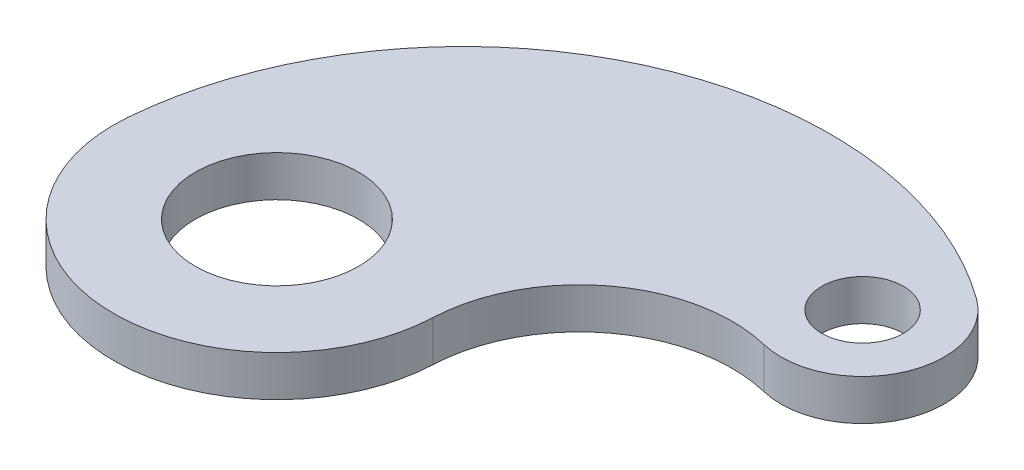
ISO-10303-21;
HEADER;
FILE_DESCRIPTION(('STEP AP214'),'2;1');
FILE_NAME('part.step','',(''),(''),'','','');
FILE_SCHEMA(('AUTOMOTIVE_DESIGN { 1 0 10303 214 1 1 1 1 }'));
ENDSEC;
DATA;
#1=APPLICATION_CONTEXT('core data for automotive mechanical design processes');
#2=APPLICATION_PROTOCOL_DEFINITION('international standard','automotive_design',2000,#1);
#3=PRODUCT_CONTEXT('',#1,'mechanical');
#4=PRODUCT('Part','Part','',(#3));
#5=PRODUCT_RELATED_PRODUCT_CATEGORY('part','',(#4));
#6=PRODUCT_DEFINITION_FORMATION('','',#4);
#7=PRODUCT_DEFINITION_CONTEXT('part definition',#1,'design');
#8=PRODUCT_DEFINITION('design','',#6,#7);
#9=PRODUCT_DEFINITION_SHAPE('','',#8);
#10=(LENGTH_UNIT() NAMED_UNIT(*) SI_UNIT(.MILLI.,.METRE.));
#11=(NAMED_UNIT(*) PLANE_ANGLE_UNIT() SI_UNIT($,.RADIAN.));
#12=(NAMED_UNIT(*) SI_UNIT($,.STERADIAN.) SOLID_ANGLE_UNIT());
#13=UNCERTAINTY_MEASURE_WITH_UNIT(LENGTH_MEASURE(1.E-05),#10,'distance_accuracy_value','');
#14=(GEOMETRIC_REPRESENTATION_CONTEXT(3) GLOBAL_UNCERTAINTY_ASSIGNED_CONTEXT((#13)) GLOBAL_UNIT_ASSIGNED_CONTEXT((#10,
#11,#12)) REPRESENTATION_CONTEXT('',''));
#15=CARTESIAN_POINT('',(0.,0.,0.));
#16=DIRECTION('',(0.,0.,1.));
#17=DIRECTION('',(1.,0.,0.));
#18=AXIS2_PLACEMENT_3D('',#15,#16,#17);
#19=CARTESIAN_POINT('',(49.8266857113889,20.,4.15949408203427));
#20=DIRECTION('',(0.,1.,0.));
#21=DIRECTION('',(0.,0.,1.));
#22=AXIS2_PLACEMENT_3D('',#19,#20,#21);
#23=PLANE('',#22);
#24=CARTESIAN_POINT('',(0.,20.,0.));
#25=DIRECTION('',(0.,1.,0.));
#26=DIRECTION('',(0.,0.,1.));
#27=AXIS2_PLACEMENT_3D('',#24,#25,#26);
#28=CIRCLE('',#27,40.);
#29=CARTESIAN_POINT('',(0.,20.,40.));
#30=VERTEX_POINT('',#29);
#31=EDGE_CURVE('E118',#30,#30,#28,.T.);
#32=ORIENTED_EDGE('',*,*,#31,.F.);
#33=EDGE_LOOP('',(#32));
#34=FACE_BOUND('',#33,.T.);
#35=CARTESIAN_POINT('',(99.6533714227777,20.,8.31898816406854));
#36=DIRECTION('',(0.,1.,0.));
#37=DIRECTION('',(0.,0.,1.));
#38=AXIS2_PLACEMENT_3D('',#35,#36,#37);
#39=CIRCLE('',#38,180.);
#40=CARTESIAN_POINT('',(205.354467186718,20.,-137.376853761164));
#41=VERTEX_POINT('',#40);
#42=CARTESIAN_POINT('',(-79.7226971382222,20.,-6.65519053125484));
#43=VERTEX_POINT('',#42);
#44=EDGE_CURVE('E98',#41,#43,#39,.T.);
#45=ORIENTED_EDGE('',*,*,#44,.T.);
#46=CARTESIAN_POINT('',(0.,20.,0.));
#47=DIRECTION('',(0.,1.,0.));
#48=DIRECTION('',(0.,0.,1.));
#49=AXIS2_PLACEMENT_3D('',#46,#47,#48);
#50=CIRCLE('',#49,80.);
#51=CARTESIAN_POINT('',(79.9233798492186,20.,3.5004790354358));
#52=VERTEX_POINT('',#51);
#53=EDGE_CURVE('E93',#43,#52,#50,.T.);
#54=ORIENTED_EDGE('',*,*,#53,.T.);
#55=CARTESIAN_POINT('',(154.851548457861,20.,6.78217813115695));
#56=DIRECTION('',(0.,-1.,0.));
#57=DIRECTION('',(0.,0.,1.));
#58=AXIS2_PLACEMENT_3D('',#55,#56,#57);
#59=CIRCLE('',#58,75.);
#60=CARTESIAN_POINT('',(172.469235199298,20.,-66.1192423891634));
#61=VERTEX_POINT('',#60);
#62=EDGE_CURVE('E96',#52,#61,#59,.T.);
#63=ORIENTED_EDGE('',*,*,#62,.T.);
#64=CARTESIAN_POINT('',(181.865334794732,20.,-105.000000000001));
#65=DIRECTION('',(0.,1.,0.));
#66=DIRECTION('',(0.,0.,1.));
#67=AXIS2_PLACEMENT_3D('',#64,#65,#66);
#68=CIRCLE('',#67,40.);
#69=EDGE_CURVE('E63',#61,#41,#68,.T.);
#70=ORIENTED_EDGE('',*,*,#69,.T.);
#71=EDGE_LOOP('',(#45,#54,#63,#70));
#72=FACE_BOUND('',#71,.T.);
#73=CARTESIAN_POINT('',(181.865334794732,20.,-105.000000000001));
#74=DIRECTION('',(0.,1.,0.));
#75=DIRECTION('',(0.,0.,1.));
#76=AXIS2_PLACEMENT_3D('',#73,#74,#75);
#77=CIRCLE('',#76,20.);
#78=CARTESIAN_POINT('',(181.865334794732,20.,-85.0000000000009));
#79=VERTEX_POINT('',#78);
#80=EDGE_CURVE('E140',#79,#79,#77,.T.);
#81=ORIENTED_EDGE('',*,*,#80,.F.);
#82=EDGE_LOOP('',(#81));
#83=FACE_BOUND('',#82,.T.);
#84=ADVANCED_FACE('F45',(#34,#72,#83),#23,.T.);
#85=CARTESIAN_POINT('',(49.8266857113889,0.,4.15949408203427));
#86=DIRECTION('',(0.,1.,0.));
#87=DIRECTION('',(0.,0.,1.));
#88=AXIS2_PLACEMENT_3D('',#85,#86,#87);
#89=PLANE('',#88);
#90=CARTESIAN_POINT('',(99.6533714227777,0.,8.31898816406854));
#91=DIRECTION('',(0.,1.,0.));
#92=DIRECTION('',(0.,0.,1.));
#93=AXIS2_PLACEMENT_3D('',#90,#91,#92);
#94=CIRCLE('',#93,180.);
#95=CARTESIAN_POINT('',(205.354467186718,0.,-137.376853761164));
#96=VERTEX_POINT('',#95);
#97=CARTESIAN_POINT('',(-79.7226971382222,0.,-6.65519053125484));
#98=VERTEX_POINT('',#97);
#99=EDGE_CURVE('E114',#96,#98,#94,.T.);
#100=ORIENTED_EDGE('',*,*,#99,.F.);
#101=CARTESIAN_POINT('',(181.865334794732,0.,-105.000000000001));
#102=DIRECTION('',(0.,1.,0.));
#103=DIRECTION('',(0.,0.,1.));
#104=AXIS2_PLACEMENT_3D('',#101,#102,#103);
#105=CIRCLE('',#104,40.);
#106=CARTESIAN_POINT('',(172.469235199298,0.,-66.1192423891634));
#107=VERTEX_POINT('',#106);
#108=EDGE_CURVE('E86',#107,#96,#105,.T.);
#109=ORIENTED_EDGE('',*,*,#108,.F.);
#110=CARTESIAN_POINT('',(154.851548457861,0.,6.78217813115695));
#111=DIRECTION('',(0.,-1.,0.));
#112=DIRECTION('',(0.,0.,1.));
#113=AXIS2_PLACEMENT_3D('',#110,#111,#112);
#114=CIRCLE('',#113,75.);
#115=CARTESIAN_POINT('',(79.9233798492186,0.,3.5004790354358));
#116=VERTEX_POINT('',#115);
#117=EDGE_CURVE('E80',#116,#107,#114,.T.);
#118=ORIENTED_EDGE('',*,*,#117,.F.);
#119=CARTESIAN_POINT('',(0.,0.,0.));
#120=DIRECTION('',(0.,1.,0.));
#121=DIRECTION('',(0.,0.,1.));
#122=AXIS2_PLACEMENT_3D('',#119,#120,#121);
#123=CIRCLE('',#122,80.);
#124=EDGE_CURVE('E103',#98,#116,#123,.T.);
#125=ORIENTED_EDGE('',*,*,#124,.F.);
#126=EDGE_LOOP('',(#100,#109,#118,#125));
#127=FACE_BOUND('',#126,.T.);
#128=CARTESIAN_POINT('',(0.,0.,0.));
#129=DIRECTION('',(0.,1.,0.));
#130=DIRECTION('',(0.,0.,1.));
#131=AXIS2_PLACEMENT_3D('',#128,#129,#130);
#132=CIRCLE('',#131,40.);
#133=CARTESIAN_POINT('',(0.,0.,40.));
#134=VERTEX_POINT('',#133);
#135=EDGE_CURVE('E136',#134,#134,#132,.T.);
#136=ORIENTED_EDGE('',*,*,#135,.T.);
#137=EDGE_LOOP('',(#136));
#138=FACE_BOUND('',#137,.T.);
#139=CARTESIAN_POINT('',(181.865334794732,0.,-105.000000000001));
#140=DIRECTION('',(0.,1.,0.));
#141=DIRECTION('',(0.,0.,1.));
#142=AXIS2_PLACEMENT_3D('',#139,#140,#141);
#143=CIRCLE('',#142,20.);
#144=CARTESIAN_POINT('',(181.865334794732,0.,-85.0000000000009));
#145=VERTEX_POINT('',#144);
#146=EDGE_CURVE('E144',#145,#145,#143,.T.);
#147=ORIENTED_EDGE('',*,*,#146,.T.);
#148=EDGE_LOOP('',(#147));
#149=FACE_BOUND('',#148,.T.);
#150=ADVANCED_FACE('F131',(#127,#138,#149),#89,.F.);
#151=CARTESIAN_POINT('',(99.6533714227777,20.,8.31898816406854));
#152=DIRECTION('',(0.,-1.,0.));
#153=DIRECTION('',(0.,0.,-1.));
#154=AXIS2_PLACEMENT_3D('',#151,#152,#153);
#155=CYLINDRICAL_SURFACE('',#154,180.);
#156=ORIENTED_EDGE('',*,*,#99,.T.);
#157=DIRECTION('',(0.,-1.,0.));
#158=VECTOR('',#157,1.);
#159=CARTESIAN_POINT('',(-79.7226971382222,20.,-6.65519053125484));
#160=LINE('',#159,#158);
#161=EDGE_CURVE('E11',#43,#98,#160,.T.);
#162=ORIENTED_EDGE('',*,*,#161,.F.);
#163=ORIENTED_EDGE('',*,*,#44,.F.);
#164=DIRECTION('',(0.,-1.,0.));
#165=VECTOR('',#164,1.);
#166=CARTESIAN_POINT('',(205.354467186718,20.,-137.376853761164));
#167=LINE('',#166,#165);
#168=EDGE_CURVE('E110',#41,#96,#167,.T.);
#169=ORIENTED_EDGE('',*,*,#168,.T.);
#170=EDGE_LOOP('',(#156,#162,#163,#169));
#171=FACE_BOUND('',#170,.T.);
#172=ADVANCED_FACE('F47',(#171),#155,.T.);
#173=CARTESIAN_POINT('',(0.,20.,0.));
#174=DIRECTION('',(0.,-1.,0.));
#175=DIRECTION('',(0.,0.,-1.));
#176=AXIS2_PLACEMENT_3D('',#173,#174,#175);
#177=CYLINDRICAL_SURFACE('',#176,80.);
#178=ORIENTED_EDGE('',*,*,#124,.T.);
#179=DIRECTION('',(0.,-1.,0.));
#180=VECTOR('',#179,1.);
#181=CARTESIAN_POINT('',(79.9233798492186,20.,3.5004790354358));
#182=LINE('',#181,#180);
#183=EDGE_CURVE('E55',#52,#116,#182,.T.);
#184=ORIENTED_EDGE('',*,*,#183,.F.);
#185=ORIENTED_EDGE('',*,*,#53,.F.);
#186=ORIENTED_EDGE('',*,*,#161,.T.);
#187=EDGE_LOOP('',(#178,#184,#185,#186));
#188=FACE_BOUND('',#187,.T.);
#189=ADVANCED_FACE('F102',(#188),#177,.T.);
#190=CARTESIAN_POINT('',(154.851548457861,20.,6.78217813115695));
#191=DIRECTION('',(0.,-1.,0.));
#192=DIRECTION('',(0.,0.,-1.));
#193=AXIS2_PLACEMENT_3D('',#190,#191,#192);
#194=CYLINDRICAL_SURFACE('',#193,75.);
#195=ORIENTED_EDGE('',*,*,#117,.T.);
#196=DIRECTION('',(0.,-1.,0.));
#197=VECTOR('',#196,1.);
#198=CARTESIAN_POINT('',(172.469235199298,20.,-66.1192423891634));
#199=LINE('',#198,#197);
#200=EDGE_CURVE('E105',#61,#107,#199,.T.);
#201=ORIENTED_EDGE('',*,*,#200,.F.);
#202=ORIENTED_EDGE('',*,*,#62,.F.);
#203=ORIENTED_EDGE('',*,*,#183,.T.);
#204=EDGE_LOOP('',(#195,#201,#202,#203));
#205=FACE_BOUND('',#204,.T.);
#206=ADVANCED_FACE('F106',(#205),#194,.F.);
#207=CARTESIAN_POINT('',(181.865334794732,20.,-105.000000000001));
#208=DIRECTION('',(0.,-1.,0.));
#209=DIRECTION('',(0.,0.,-1.));
#210=AXIS2_PLACEMENT_3D('',#207,#208,#209);
#211=CYLINDRICAL_SURFACE('',#210,40.);
#212=ORIENTED_EDGE('',*,*,#108,.T.);
#213=ORIENTED_EDGE('',*,*,#168,.F.);
#214=ORIENTED_EDGE('',*,*,#69,.F.);
#215=ORIENTED_EDGE('',*,*,#200,.T.);
#216=EDGE_LOOP('',(#212,#213,#214,#215));
#217=FACE_BOUND('',#216,.T.);
#218=ADVANCED_FACE('F128',(#217),#211,.T.);
#219=CARTESIAN_POINT('',(0.,20.,0.));
#220=DIRECTION('',(0.,-1.,0.));
#221=DIRECTION('',(0.,0.,-1.));
#222=AXIS2_PLACEMENT_3D('',#219,#220,#221);
#223=CYLINDRICAL_SURFACE('',#222,40.);
#224=ORIENTED_EDGE('',*,*,#31,.T.);
#225=EDGE_LOOP('',(#224));
#226=FACE_BOUND('',#225,.T.);
#227=ORIENTED_EDGE('',*,*,#135,.F.);
#228=EDGE_LOOP('',(#227));
#229=FACE_BOUND('',#228,.T.);
#230=ADVANCED_FACE('F163',(#226,#229),#223,.F.);
#231=CARTESIAN_POINT('',(181.865334794732,20.,-105.000000000001));
#232=DIRECTION('',(0.,-1.,0.));
#233=DIRECTION('',(0.,0.,-1.));
#234=AXIS2_PLACEMENT_3D('',#231,#232,#233);
#235=CYLINDRICAL_SURFACE('',#234,20.);
#236=ORIENTED_EDGE('',*,*,#80,.T.);
#237=EDGE_LOOP('',(#236));
#238=FACE_BOUND('',#237,.T.);
#239=ORIENTED_EDGE('',*,*,#146,.F.);
#240=EDGE_LOOP('',(#239));
#241=FACE_BOUND('',#240,.T.);
#242=ADVANCED_FACE('F152',(#238,#241),#235,.F.);
#243=CLOSED_SHELL('',(#84,#150,#172,#189,#206,#218,#230,#242));
#244=MANIFOLD_SOLID_BREP('B2',#243);
#245=ADVANCED_BREP_SHAPE_REPRESENTATION('',(#18,#244),#14);
#246=SHAPE_DEFINITION_REPRESENTATION(#9,#245);
ENDSEC;
END-ISO-10303-21;
